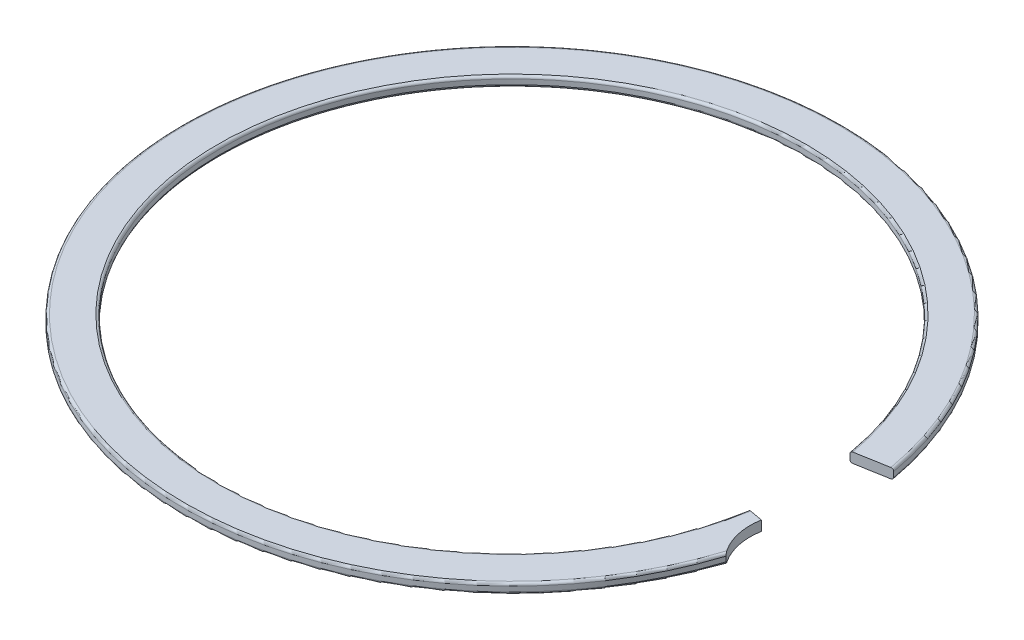
ISO-10303-21;
HEADER;
FILE_DESCRIPTION(('STEP AP214'),'2;1');
FILE_NAME('part.step','',(''),(''),'','','');
FILE_SCHEMA(('AUTOMOTIVE_DESIGN { 1 0 10303 214 1 1 1 1 }'));
ENDSEC;
DATA;
#1=APPLICATION_CONTEXT('core data for automotive mechanical design processes');
#2=APPLICATION_PROTOCOL_DEFINITION('international standard','automotive_design',2000,#1);
#3=PRODUCT_CONTEXT('',#1,'mechanical');
#4=PRODUCT('Part','Part','',(#3));
#5=PRODUCT_RELATED_PRODUCT_CATEGORY('part','',(#4));
#6=PRODUCT_DEFINITION_FORMATION('','',#4);
#7=PRODUCT_DEFINITION_CONTEXT('part definition',#1,'design');
#8=PRODUCT_DEFINITION('design','',#6,#7);
#9=PRODUCT_DEFINITION_SHAPE('','',#8);
#10=(LENGTH_UNIT() NAMED_UNIT(*) SI_UNIT(.MILLI.,.METRE.));
#11=(NAMED_UNIT(*) PLANE_ANGLE_UNIT() SI_UNIT($,.RADIAN.));
#12=(NAMED_UNIT(*) SI_UNIT($,.STERADIAN.) SOLID_ANGLE_UNIT());
#13=UNCERTAINTY_MEASURE_WITH_UNIT(LENGTH_MEASURE(1.E-05),#10,'distance_accuracy_value','');
#14=(GEOMETRIC_REPRESENTATION_CONTEXT(3) GLOBAL_UNCERTAINTY_ASSIGNED_CONTEXT((#13)) GLOBAL_UNIT_ASSIGNED_CONTEXT((#10,
#11,#12)) REPRESENTATION_CONTEXT('',''));
#15=CARTESIAN_POINT('',(0.,0.,0.));
#16=DIRECTION('',(0.,0.,1.));
#17=DIRECTION('',(1.,0.,0.));
#18=AXIS2_PLACEMENT_3D('',#15,#16,#17);
#19=CARTESIAN_POINT('',(0.,0.196850000000726,0.));
#20=DIRECTION('',(0.,1.,0.));
#21=DIRECTION('',(0.,0.,1.));
#22=AXIS2_PLACEMENT_3D('',#19,#20,#21);
#23=TOROIDAL_SURFACE('',#22,23.3235499999993,0.196849999999274);
#24=CARTESIAN_POINT('',(0.,0.196850000000026,0.));
#25=DIRECTION('',(0.,1.,0.));
#26=DIRECTION('',(0.,0.,1.));
#27=AXIS2_PLACEMENT_3D('',#24,#25,#26);
#28=CIRCLE('',#27,23.1267);
#29=CARTESIAN_POINT('',(22.7753534615874,0.196850000000026,-4.0159093104498));
#30=VERTEX_POINT('',#29);
#31=CARTESIAN_POINT('',(22.7753534615874,0.196850000000026,4.01590931044978));
#32=VERTEX_POINT('',#31);
#33=EDGE_CURVE('E185',#30,#32,#28,.T.);
#34=ORIENTED_EDGE('',*,*,#33,.F.);
#35=CARTESIAN_POINT('',(22.9692128677672,0.196850000000726,-4.05009195422341));
#36=DIRECTION('',(-0.17364817766693,0.,-0.984807753012208));
#37=DIRECTION('',(-0.984807753012208,0.,0.17364817766693));
#38=AXIS2_PLACEMENT_3D('',#35,#36,#37);
#39=CIRCLE('',#38,0.196849999999274);
#40=CARTESIAN_POINT('',(22.9692128677679,0.393700000000052,-4.05009195422353));
#41=VERTEX_POINT('',#40);
#42=EDGE_CURVE('E221',#30,#41,#39,.T.);
#43=ORIENTED_EDGE('',*,*,#42,.T.);
#44=CARTESIAN_POINT('',(0.,0.393700000000052,0.));
#45=DIRECTION('',(0.,1.,0.));
#46=DIRECTION('',(0.,0.,1.));
#47=AXIS2_PLACEMENT_3D('',#44,#45,#46);
#48=CIRCLE('',#47,23.32355);
#49=CARTESIAN_POINT('',(22.9692128677679,0.393700000000052,4.05009195422352));
#50=VERTEX_POINT('',#49);
#51=EDGE_CURVE('E210',#41,#50,#48,.T.);
#52=ORIENTED_EDGE('',*,*,#51,.T.);
#53=CARTESIAN_POINT('',(22.9692128677672,0.196850000000726,4.05009195422339));
#54=DIRECTION('',(-0.17364817766693,0.,0.984807753012208));
#55=DIRECTION('',(0.984807753012208,0.,0.17364817766693));
#56=AXIS2_PLACEMENT_3D('',#53,#54,#55);
#57=CIRCLE('',#56,0.196849999999274);
#58=EDGE_CURVE('E57',#50,#32,#57,.T.);
#59=ORIENTED_EDGE('',*,*,#58,.T.);
#60=EDGE_LOOP('',(#34,#43,#52,#59));
#61=FACE_BOUND('',#60,.T.);
#62=ADVANCED_FACE('F36',(#61),#23,.T.);
#63=CARTESIAN_POINT('',(0.,-1270.,0.));
#64=DIRECTION('',(0.,1.,0.));
#65=DIRECTION('',(0.,0.,1.));
#66=AXIS2_PLACEMENT_3D('',#63,#64,#65);
#67=CYLINDRICAL_SURFACE('',#66,23.1267);
#68=CARTESIAN_POINT('',(0.,-0.196850000000026,0.));
#69=DIRECTION('',(0.,1.,0.));
#70=DIRECTION('',(0.,0.,1.));
#71=AXIS2_PLACEMENT_3D('',#68,#69,#70);
#72=CIRCLE('',#71,23.1267);
#73=CARTESIAN_POINT('',(22.7753534615874,-0.196850000000026,-4.0159093104498));
#74=VERTEX_POINT('',#73);
#75=CARTESIAN_POINT('',(22.7753534615874,-0.196850000000026,4.01590931044978));
#76=VERTEX_POINT('',#75);
#77=EDGE_CURVE('E180',#74,#76,#72,.T.);
#78=ORIENTED_EDGE('',*,*,#77,.F.);
#79=DIRECTION('',(0.,1.,0.));
#80=VECTOR('',#79,1.);
#81=CARTESIAN_POINT('',(22.7753534615874,-1270.,-4.0159093104498));
#82=LINE('',#81,#80);
#83=EDGE_CURVE('E182',#74,#30,#82,.T.);
#84=ORIENTED_EDGE('',*,*,#83,.T.);
#85=ORIENTED_EDGE('',*,*,#33,.T.);
#86=DIRECTION('',(0.,1.,0.));
#87=VECTOR('',#86,1.);
#88=CARTESIAN_POINT('',(22.7753534615874,-1270.,4.01590931044978));
#89=LINE('',#88,#87);
#90=EDGE_CURVE('E133',#32,#76,#89,.F.);
#91=ORIENTED_EDGE('',*,*,#90,.T.);
#92=EDGE_LOOP('',(#78,#84,#85,#91));
#93=FACE_BOUND('',#92,.T.);
#94=ADVANCED_FACE('F168',(#93),#67,.F.);
#95=CARTESIAN_POINT('',(0.,-0.196850000000733,0.));
#96=DIRECTION('',(0.,1.,0.));
#97=DIRECTION('',(0.,0.,1.));
#98=AXIS2_PLACEMENT_3D('',#95,#96,#97);
#99=TOROIDAL_SURFACE('',#98,23.3235499999993,0.196849999999267);
#100=CARTESIAN_POINT('',(0.,-0.393700000000052,0.));
#101=DIRECTION('',(0.,1.,0.));
#102=DIRECTION('',(0.,0.,1.));
#103=AXIS2_PLACEMENT_3D('',#100,#101,#102);
#104=CIRCLE('',#103,23.32355);
#105=CARTESIAN_POINT('',(22.9692128677679,-0.393700000000052,-4.05009195422353));
#106=VERTEX_POINT('',#105);
#107=CARTESIAN_POINT('',(22.9692128677675,-0.393700000000026,4.05009195422345));
#108=VERTEX_POINT('',#107);
#109=EDGE_CURVE('E126',#106,#108,#104,.T.);
#110=ORIENTED_EDGE('',*,*,#109,.F.);
#111=CARTESIAN_POINT('',(22.9692128677672,-0.196850000000733,-4.0500919542234));
#112=DIRECTION('',(-0.17364817766693,0.,-0.984807753012208));
#113=DIRECTION('',(-0.984807753012208,0.,0.17364817766693));
#114=AXIS2_PLACEMENT_3D('',#111,#112,#113);
#115=CIRCLE('',#114,0.196849999999267);
#116=EDGE_CURVE('E217',#106,#74,#115,.T.);
#117=ORIENTED_EDGE('',*,*,#116,.T.);
#118=ORIENTED_EDGE('',*,*,#77,.T.);
#119=CARTESIAN_POINT('',(22.9692128677672,-0.196850000000733,4.05009195422339));
#120=DIRECTION('',(-0.17364817766693,0.,0.984807753012208));
#121=DIRECTION('',(0.984807753012208,0.,0.17364817766693));
#122=AXIS2_PLACEMENT_3D('',#119,#120,#121);
#123=CIRCLE('',#122,0.196849999999267);
#124=EDGE_CURVE('E128',#76,#108,#123,.T.);
#125=ORIENTED_EDGE('',*,*,#124,.T.);
#126=EDGE_LOOP('',(#110,#117,#118,#125));
#127=FACE_BOUND('',#126,.T.);
#128=ADVANCED_FACE('F166',(#127),#99,.T.);
#129=CARTESIAN_POINT('',(23.32355,-0.3937,0.));
#130=DIRECTION('',(0.,1.,0.));
#131=DIRECTION('',(0.,0.,1.));
#132=AXIS2_PLACEMENT_3D('',#129,#130,#131);
#133=PLANE('',#132);
#134=CARTESIAN_POINT('',(0.,-0.393700000000052,0.));
#135=DIRECTION('',(0.,1.,0.));
#136=DIRECTION('',(0.,0.,1.));
#137=AXIS2_PLACEMENT_3D('',#134,#135,#136);
#138=CIRCLE('',#137,25.92705);
#139=CARTESIAN_POINT('',(25.5331598527355,-0.393700000000027,-4.50218498477945));
#140=VERTEX_POINT('',#139);
#141=CARTESIAN_POINT('',(24.7509730296569,-0.393700000000001,7.72018495812728));
#142=VERTEX_POINT('',#141);
#143=EDGE_CURVE('E188',#140,#142,#138,.T.);
#144=ORIENTED_EDGE('',*,*,#143,.F.);
#145=DIRECTION('',(-0.984807753012208,0.,0.17364817766693));
#146=VECTOR('',#145,1.);
#147=CARTESIAN_POINT('',(22.6202589127656,-0.3937,-3.9885619569317));
#148=LINE('',#147,#146);
#149=EDGE_CURVE('E216',#140,#106,#148,.T.);
#150=ORIENTED_EDGE('',*,*,#149,.T.);
#151=ORIENTED_EDGE('',*,*,#109,.T.);
#152=DIRECTION('',(0.984807753012208,0.,0.17364817766693));
#153=VECTOR('',#152,1.);
#154=CARTESIAN_POINT('',(22.6202589127656,-0.3937,3.98856195693168));
#155=LINE('',#154,#153);
#156=CARTESIAN_POINT('',(24.005214210474,-0.3937,4.2327669429928));
#157=VERTEX_POINT('',#156);
#158=EDGE_CURVE('E118',#108,#157,#155,.T.);
#159=ORIENTED_EDGE('',*,*,#158,.T.);
#160=CARTESIAN_POINT('',(28.6786850562443,-0.3937,5.05682594665613));
#161=DIRECTION('',(0.,1.,0.));
#162=DIRECTION('',(0.,0.,1.));
#163=AXIS2_PLACEMENT_3D('',#160,#161,#162);
#164=CIRCLE('',#163,4.74556666666729);
#165=EDGE_CURVE('E105',#157,#142,#164,.T.);
#166=ORIENTED_EDGE('',*,*,#165,.T.);
#167=EDGE_LOOP('',(#144,#150,#151,#159,#166));
#168=FACE_BOUND('',#167,.T.);
#169=ADVANCED_FACE('F123',(#168),#133,.F.);
#170=CARTESIAN_POINT('',(0.,-0.196850000000732,0.));
#171=DIRECTION('',(0.,1.,0.));
#172=DIRECTION('',(0.,0.,1.));
#173=AXIS2_PLACEMENT_3D('',#170,#171,#172);
#174=TOROIDAL_SURFACE('',#173,25.9270500000007,0.196849999999269);
#175=CARTESIAN_POINT('',(0.,-0.196850000000026,0.));
#176=DIRECTION('',(0.,1.,0.));
#177=DIRECTION('',(0.,0.,1.));
#178=AXIS2_PLACEMENT_3D('',#175,#176,#177);
#179=CIRCLE('',#178,26.1239);
#180=CARTESIAN_POINT('',(25.7270192589156,-0.196850000000026,-4.53636762855312));
#181=VERTEX_POINT('',#180);
#182=CARTESIAN_POINT('',(24.8943371455688,-0.19685,7.92023543164939));
#183=VERTEX_POINT('',#182);
#184=EDGE_CURVE('E206',#181,#183,#179,.T.);
#185=ORIENTED_EDGE('',*,*,#184,.F.);
#186=CARTESIAN_POINT('',(25.5331598527359,-0.196850000000732,-4.50218498477951));
#187=DIRECTION('',(-0.17364817766693,0.,-0.984807753012208));
#188=DIRECTION('',(-0.984807753012208,0.,0.17364817766693));
#189=AXIS2_PLACEMENT_3D('',#186,#187,#188);
#190=CIRCLE('',#189,0.196849999999269);
#191=EDGE_CURVE('E215',#181,#140,#190,.T.);
#192=ORIENTED_EDGE('',*,*,#191,.T.);
#193=ORIENTED_EDGE('',*,*,#143,.T.);
#194=CARTESIAN_POINT('',(24.6120216636509,-0.19665,7.50277194751647));
#195=CARTESIAN_POINT('',(24.6120053281374,-0.20578616960296,7.50274324151172));
#196=CARTESIAN_POINT('',(24.6124493381975,-0.214902542092029,7.50348304586439));
#197=CARTESIAN_POINT('',(24.6141724133713,-0.232762119013125,7.50634521588683));
#198=CARTESIAN_POINT('',(24.6154447625386,-0.241507727254608,7.50845646198035));
#199=CARTESIAN_POINT('',(24.6187371578279,-0.258426189964681,7.51390458446985));
#200=CARTESIAN_POINT('',(24.6207553724683,-0.266600389551291,7.51723845853555));
#201=CARTESIAN_POINT('',(24.6254295383492,-0.282266627860195,7.52493112062579));
#202=CARTESIAN_POINT('',(24.6280868258615,-0.289757191248684,7.52929205578648));
#203=CARTESIAN_POINT('',(24.6350116822548,-0.30659444676171,7.54060672029049));
#204=CARTESIAN_POINT('',(24.6395112588494,-0.315602306246769,7.54792274699867));
#205=CARTESIAN_POINT('',(24.6492631611516,-0.332111344804953,7.56366627120311));
#206=CARTESIAN_POINT('',(24.6545168116429,-0.339609815228371,7.57209572268031));
#207=CARTESIAN_POINT('',(24.6672212843514,-0.355099503801103,7.59232235047158));
#208=CARTESIAN_POINT('',(24.6748645048158,-0.36258980351731,7.60438198184365));
#209=CARTESIAN_POINT('',(24.6908149360515,-0.37515426556299,7.62927891156786));
#210=CARTESIAN_POINT('',(24.699122495602,-0.380227148889355,7.64211661754304));
#211=CARTESIAN_POINT('',(24.7163082264311,-0.388063004485192,7.66838150331697));
#212=CARTESIAN_POINT('',(24.7251927634569,-0.390792604054023,7.681814423276));
#213=CARTESIAN_POINT('',(24.7432312847788,-0.39381484688499,7.70878184597441));
#214=CARTESIAN_POINT('',(24.7523854175125,-0.39410612146113,7.72231640149874));
#215=CARTESIAN_POINT('',(24.7717849712028,-0.392079068145761,7.75068221074878));
#216=CARTESIAN_POINT('',(24.7820377345745,-0.389464664917536,7.76548882239302));
#217=CARTESIAN_POINT('',(24.8022609247312,-0.380987803134823,7.79435184271515));
#218=CARTESIAN_POINT('',(24.8122317022661,-0.375129584707585,7.80840920452787));
#219=CARTESIAN_POINT('',(24.8286401771391,-0.362199070330091,7.83129810598811));
#220=CARTESIAN_POINT('',(24.8352680132893,-0.355963104906746,7.84046822514253));
#221=CARTESIAN_POINT('',(24.8479014206407,-0.341743482105297,7.85782832097927));
#222=CARTESIAN_POINT('',(24.8539079247485,-0.333762502600677,7.86601977005052));
#223=CARTESIAN_POINT('',(24.8640836447223,-0.317579043498438,7.87981728760974));
#224=CARTESIAN_POINT('',(24.8683920686244,-0.309637874643762,7.88562656984962));
#225=CARTESIAN_POINT('',(24.8761934559346,-0.292661697684965,7.89610460740827));
#226=CARTESIAN_POINT('',(24.8796863462794,-0.283626591685593,7.90077326054038));
#227=CARTESIAN_POINT('',(24.8856801130049,-0.264580231793558,7.90876245229863));
#228=CARTESIAN_POINT('',(24.8881732875329,-0.254562112525949,7.91207252882408));
#229=CARTESIAN_POINT('',(24.8919494341722,-0.233922985446788,7.91707881224621));
#230=CARTESIAN_POINT('',(24.8932355691802,-0.223303631053033,7.91877923713642));
#231=CARTESIAN_POINT('',(24.8940284241214,-0.209947018550713,7.91982736892199));
#232=CARTESIAN_POINT('',(24.8941459159984,-0.207289468369141,7.91998267814134));
#233=CARTESIAN_POINT('',(24.8943010987596,-0.201971666241024,7.92018779908984));
#234=CARTESIAN_POINT('',(24.8943389001685,-0.199311423162808,7.92023775693355));
#235=CARTESIAN_POINT('',(24.8943370705108,-0.19665,7.92023533245099));
#236=B_SPLINE_CURVE_WITH_KNOTS('',3,(#194,#195,#196,#197,#198,#199,#200,#201,#202,#203,#204,
#205,#206,#207,#208,#209,#210,#211,#212,#213,#214,#215,#216,#217,#218,#219,#220,#221,#222,#223,
#224,#225,#226,#227,#228,#229,#230,#231,#232,#233,#234,#235),.UNSPECIFIED.,.F.,.F.,(4,2,2,2,2,2,
2,2,2,2,2,2,2,2,2,2,2,2,2,2,4),(0.,0.0273334363781665,0.0544479751697251,0.0814963715371977,
0.108601824245544,0.145737339395138,0.182938912757049,0.231055385730162,0.279197287909275,
0.328013955395857,0.376858022926466,0.431175294084187,0.485421731890154,0.52403606905831,
0.562591559999642,0.594685103694849,0.626781521532241,0.659120668029442,0.691374835255036,
0.699366865413399,0.707347803909089),.UNSPECIFIED.);
#237=EDGE_CURVE('E111',#142,#183,#236,.T.);
#238=ORIENTED_EDGE('',*,*,#237,.T.);
#239=EDGE_LOOP('',(#185,#192,#193,#238));
#240=FACE_BOUND('',#239,.T.);
#241=ADVANCED_FACE('F158',(#240),#174,.T.);
#242=CARTESIAN_POINT('',(0.,-1270.,0.));
#243=DIRECTION('',(0.,1.,0.));
#244=DIRECTION('',(0.,0.,1.));
#245=AXIS2_PLACEMENT_3D('',#242,#243,#244);
#246=CYLINDRICAL_SURFACE('',#245,26.1239);
#247=CARTESIAN_POINT('',(0.,0.196850000000026,0.));
#248=DIRECTION('',(0.,1.,0.));
#249=DIRECTION('',(0.,0.,1.));
#250=AXIS2_PLACEMENT_3D('',#247,#248,#249);
#251=CIRCLE('',#250,26.1239);
#252=CARTESIAN_POINT('',(25.7270192589156,0.196850000000026,-4.53636762855312));
#253=VERTEX_POINT('',#252);
#254=CARTESIAN_POINT('',(24.8943371455688,0.196850000000026,7.92023543164939));
#255=VERTEX_POINT('',#254);
#256=EDGE_CURVE('E203',#253,#255,#251,.T.);
#257=ORIENTED_EDGE('',*,*,#256,.F.);
#258=DIRECTION('',(0.,1.,0.));
#259=VECTOR('',#258,1.);
#260=CARTESIAN_POINT('',(25.7270192589156,-1270.,-4.53636762855312));
#261=LINE('',#260,#259);
#262=EDGE_CURVE('E227',#253,#181,#261,.F.);
#263=ORIENTED_EDGE('',*,*,#262,.T.);
#264=ORIENTED_EDGE('',*,*,#184,.T.);
#265=DIRECTION('',(0.,1.,0.));
#266=VECTOR('',#265,1.);
#267=CARTESIAN_POINT('',(24.8943371455688,0.,7.92023543164939));
#268=LINE('',#267,#266);
#269=EDGE_CURVE('E131',#183,#255,#268,.T.);
#270=ORIENTED_EDGE('',*,*,#269,.T.);
#271=EDGE_LOOP('',(#257,#263,#264,#270));
#272=FACE_BOUND('',#271,.T.);
#273=ADVANCED_FACE('F162',(#272),#246,.T.);
#274=CARTESIAN_POINT('',(0.,0.196850000000732,0.));
#275=DIRECTION('',(0.,1.,0.));
#276=DIRECTION('',(0.,0.,1.));
#277=AXIS2_PLACEMENT_3D('',#274,#275,#276);
#278=TOROIDAL_SURFACE('',#277,25.9270500000007,0.196849999999267);
#279=CARTESIAN_POINT('',(0.,0.393700000000052,0.));
#280=DIRECTION('',(0.,1.,0.));
#281=DIRECTION('',(0.,0.,1.));
#282=AXIS2_PLACEMENT_3D('',#279,#280,#281);
#283=CIRCLE('',#282,25.92705);
#284=CARTESIAN_POINT('',(25.5331598527352,0.393700000000052,-4.50218498477939));
#285=VERTEX_POINT('',#284);
#286=CARTESIAN_POINT('',(24.7509730296569,0.393700000000006,7.72018495812727));
#287=VERTEX_POINT('',#286);
#288=EDGE_CURVE('E198',#285,#287,#283,.T.);
#289=ORIENTED_EDGE('',*,*,#288,.F.);
#290=CARTESIAN_POINT('',(25.5331598527359,0.196850000000732,-4.50218498477951));
#291=DIRECTION('',(-0.17364817766693,0.,-0.984807753012208));
#292=DIRECTION('',(-0.984807753012208,0.,0.17364817766693));
#293=AXIS2_PLACEMENT_3D('',#290,#291,#292);
#294=CIRCLE('',#293,0.196849999999267);
#295=EDGE_CURVE('E50',#285,#253,#294,.T.);
#296=ORIENTED_EDGE('',*,*,#295,.T.);
#297=ORIENTED_EDGE('',*,*,#256,.T.);
#298=CARTESIAN_POINT('',(24.8943370705108,0.19665,7.92023533245098));
#299=CARTESIAN_POINT('',(24.8943548179951,0.206251269342245,7.92025737055517));
#300=CARTESIAN_POINT('',(24.8938332597026,0.215840252049648,7.9195694970815));
#301=CARTESIAN_POINT('',(24.8917971871505,0.23467315191497,7.91687632818644));
#302=CARTESIAN_POINT('',(24.8902879271858,0.243918622947933,7.91487800387933));
#303=CARTESIAN_POINT('',(24.8863629623182,0.261840136981412,7.90966769121156));
#304=CARTESIAN_POINT('',(24.8839483599004,0.270516857543446,7.90645717896549));
#305=CARTESIAN_POINT('',(24.8783399812769,0.287133228644253,7.89897342071792));
#306=CARTESIAN_POINT('',(24.8751453834359,0.295072089677687,7.8946990539758));
#307=CARTESIAN_POINT('',(24.8679004737694,0.310541670204039,7.884963622603));
#308=CARTESIAN_POINT('',(24.8638096657642,0.318017404058545,7.87944581056011));
#309=CARTESIAN_POINT('',(24.8550684439729,0.331914174602718,7.86759332979969));
#310=CARTESIAN_POINT('',(24.8504178296295,0.338334831338442,7.86125836827017));
#311=CARTESIAN_POINT('',(24.8398615302186,0.351109768934287,7.84679548393125));
#312=CARTESIAN_POINT('',(24.833877633683,0.357262177998882,7.83854667152634));
#313=CARTESIAN_POINT('',(24.8215284488224,0.368095548439511,7.82139786032855));
#314=CARTESIAN_POINT('',(24.8151629204263,0.372775571777332,7.81249745084382));
#315=CARTESIAN_POINT('',(24.8009148809872,0.381491639280912,7.7924211547483));
#316=CARTESIAN_POINT('',(24.7929824018175,0.385214617185394,7.78114470161956));
#317=CARTESIAN_POINT('',(24.7769997964518,0.390681660828319,7.75820543479725));
#318=CARTESIAN_POINT('',(24.7689496061604,0.392424604426656,7.74654240586971));
#319=CARTESIAN_POINT('',(24.7514756923452,0.394138705093867,7.72097856079522));
#320=CARTESIAN_POINT('',(24.7420605368109,0.393742495806363,7.70704638010653));
#321=CARTESIAN_POINT('',(24.7235115382376,0.39036643502115,7.67928374053356));
#322=CARTESIAN_POINT('',(24.7143781083939,0.387382959612734,7.66545345178051));
#323=CARTESIAN_POINT('',(24.6959055029243,0.378486722037909,7.63717037603606));
#324=CARTESIAN_POINT('',(24.6866087046283,0.372357965102687,7.62275678840367));
#325=CARTESIAN_POINT('',(24.6689401762397,0.357000566863544,7.59505702782455));
#326=CARTESIAN_POINT('',(24.6605664144254,0.34777892206135,7.58176839431145));
#327=CARTESIAN_POINT('',(24.6480370942201,0.330144655608114,7.56169418250298));
#328=CARTESIAN_POINT('',(24.6434661830846,0.322692138331042,7.55432002849892));
#329=CARTESIAN_POINT('',(24.63502980448,0.306514157640791,7.54063739916528));
#330=CARTESIAN_POINT('',(24.631163296728,0.297790606189214,7.53432735337209));
#331=CARTESIAN_POINT('',(24.6249528269752,0.280838917546909,7.5241498195678));
#332=CARTESIAN_POINT('',(24.6224599364034,0.272807304558602,7.52004692826475));
#333=CARTESIAN_POINT('',(24.6182061338691,0.256067027662558,7.51302845241814));
#334=CARTESIAN_POINT('',(24.616443734015,0.247359783309503,7.51011045468702));
#335=CARTESIAN_POINT('',(24.6140879790088,0.231653799570517,7.50620498381482));
#336=CARTESIAN_POINT('',(24.6133144798542,0.224755134400888,7.50492047821139));
#337=CARTESIAN_POINT('',(24.6122761349401,0.210790499129462,7.50319503820057));
#338=CARTESIAN_POINT('',(24.6120131717862,0.203724006705197,7.50275722600484));
#339=CARTESIAN_POINT('',(24.6120216636509,0.196650000000001,7.50277194751647));
#340=B_SPLINE_CURVE_WITH_KNOTS('',3,(#298,#299,#300,#301,#302,#303,#304,#305,#306,#307,#308,
#309,#310,#311,#312,#313,#314,#315,#316,#317,#318,#319,#320,#321,#322,#323,#324,#325,#326,#327,
#328,#329,#330,#331,#332,#333,#334,#335,#336,#337,#338,#339),.UNSPECIFIED.,.F.,.F.,(4,2,2,2,2,2,
2,2,2,2,2,2,2,2,2,2,2,2,2,2,4),(0.,0.0287429583563861,0.0573342417783977,0.0858908205140062,
0.114477611083422,0.144819559474431,0.175172410762497,0.210752704815493,0.246355620932799,
0.289037561412951,0.331743678878873,0.381993676793241,0.43231417235295,0.486675624695936,
0.540914924814807,0.575112758762552,0.609259671563257,0.637220841109197,0.665124775034645,
0.686236051471587,0.707425029145756),.UNSPECIFIED.);
#341=EDGE_CURVE('E127',#255,#287,#340,.T.);
#342=ORIENTED_EDGE('',*,*,#341,.T.);
#343=EDGE_LOOP('',(#289,#296,#297,#342));
#344=FACE_BOUND('',#343,.T.);
#345=ADVANCED_FACE('F143',(#344),#278,.T.);
#346=CARTESIAN_POINT('',(25.92705,0.3937,0.));
#347=DIRECTION('',(0.,-1.,0.));
#348=DIRECTION('',(0.,0.,-1.));
#349=AXIS2_PLACEMENT_3D('',#346,#347,#348);
#350=PLANE('',#349);
#351=ORIENTED_EDGE('',*,*,#51,.F.);
#352=DIRECTION('',(0.984807753012208,0.,-0.17364817766693));
#353=VECTOR('',#352,1.);
#354=CARTESIAN_POINT('',(25.1452537818736,0.3937,-4.43378667850589));
#355=LINE('',#354,#353);
#356=EDGE_CURVE('E11',#41,#285,#355,.T.);
#357=ORIENTED_EDGE('',*,*,#356,.T.);
#358=ORIENTED_EDGE('',*,*,#288,.T.);
#359=CARTESIAN_POINT('',(28.6786850562443,0.3937,5.05682594665613));
#360=DIRECTION('',(0.,-1.,0.));
#361=DIRECTION('',(0.,0.,-1.));
#362=AXIS2_PLACEMENT_3D('',#359,#360,#361);
#363=CIRCLE('',#362,4.74556666666729);
#364=CARTESIAN_POINT('',(24.005214210474,0.3937,4.2327669429928));
#365=VERTEX_POINT('',#364);
#366=EDGE_CURVE('E43',#287,#365,#363,.T.);
#367=ORIENTED_EDGE('',*,*,#366,.T.);
#368=DIRECTION('',(-0.984807753012208,0.,-0.17364817766693));
#369=VECTOR('',#368,1.);
#370=CARTESIAN_POINT('',(25.1452537818736,0.3937,4.43378667850587));
#371=LINE('',#370,#369);
#372=EDGE_CURVE('E120',#365,#50,#371,.T.);
#373=ORIENTED_EDGE('',*,*,#372,.T.);
#374=EDGE_LOOP('',(#351,#357,#358,#367,#373));
#375=FACE_BOUND('',#374,.T.);
#376=ADVANCED_FACE('F195',(#375),#350,.F.);
#377=CARTESIAN_POINT('',(0.,-0.7874,0.));
#378=DIRECTION('',(-0.17364817766693,0.,0.984807753012208));
#379=DIRECTION('',(0.984807753012208,0.,0.17364817766693));
#380=AXIS2_PLACEMENT_3D('',#377,#378,#379);
#381=PLANE('',#380);
#382=ORIENTED_EDGE('',*,*,#124,.F.);
#383=ORIENTED_EDGE('',*,*,#90,.F.);
#384=ORIENTED_EDGE('',*,*,#58,.F.);
#385=ORIENTED_EDGE('',*,*,#372,.F.);
#386=DIRECTION('',(0.,1.,0.));
#387=VECTOR('',#386,1.);
#388=CARTESIAN_POINT('',(24.005214210474,-0.7874,4.2327669429928));
#389=LINE('',#388,#387);
#390=EDGE_CURVE('E108',#157,#365,#389,.T.);
#391=ORIENTED_EDGE('',*,*,#390,.F.);
#392=ORIENTED_EDGE('',*,*,#158,.F.);
#393=EDGE_LOOP('',(#382,#383,#384,#385,#391,#392));
#394=FACE_BOUND('',#393,.T.);
#395=ADVANCED_FACE('F117',(#394),#381,.F.);
#396=CARTESIAN_POINT('',(28.6786850562443,-0.7874,5.05682594665613));
#397=DIRECTION('',(0.,1.,0.));
#398=DIRECTION('',(0.,0.,1.));
#399=AXIS2_PLACEMENT_3D('',#396,#397,#398);
#400=CYLINDRICAL_SURFACE('',#399,4.74556666666729);
#401=ORIENTED_EDGE('',*,*,#390,.T.);
#402=ORIENTED_EDGE('',*,*,#366,.F.);
#403=ORIENTED_EDGE('',*,*,#341,.F.);
#404=ORIENTED_EDGE('',*,*,#269,.F.);
#405=ORIENTED_EDGE('',*,*,#237,.F.);
#406=ORIENTED_EDGE('',*,*,#165,.F.);
#407=EDGE_LOOP('',(#401,#402,#403,#404,#405,#406));
#408=FACE_BOUND('',#407,.T.);
#409=ADVANCED_FACE('F107',(#408),#400,.F.);
#410=CARTESIAN_POINT('',(28.299721184807,-0.7874,-4.9900043914084));
#411=DIRECTION('',(-0.17364817766693,0.,-0.984807753012208));
#412=DIRECTION('',(-0.984807753012208,0.,0.17364817766693));
#413=AXIS2_PLACEMENT_3D('',#410,#411,#412);
#414=PLANE('',#413);
#415=ORIENTED_EDGE('',*,*,#83,.F.);
#416=ORIENTED_EDGE('',*,*,#116,.F.);
#417=ORIENTED_EDGE('',*,*,#149,.F.);
#418=ORIENTED_EDGE('',*,*,#191,.F.);
#419=ORIENTED_EDGE('',*,*,#262,.F.);
#420=ORIENTED_EDGE('',*,*,#295,.F.);
#421=ORIENTED_EDGE('',*,*,#356,.F.);
#422=ORIENTED_EDGE('',*,*,#42,.F.);
#423=EDGE_LOOP('',(#415,#416,#417,#418,#419,#420,#421,#422));
#424=FACE_BOUND('',#423,.T.);
#425=ADVANCED_FACE('F150',(#424),#414,.F.);
#426=CLOSED_SHELL('',(#62,#94,#128,#169,#241,#273,#345,#376,#395,#409,#425));
#427=MANIFOLD_SOLID_BREP('B2',#426);
#428=ADVANCED_BREP_SHAPE_REPRESENTATION('',(#18,#427),#14);
#429=SHAPE_DEFINITION_REPRESENTATION(#9,#428);
ENDSEC;
END-ISO-10303-21;
